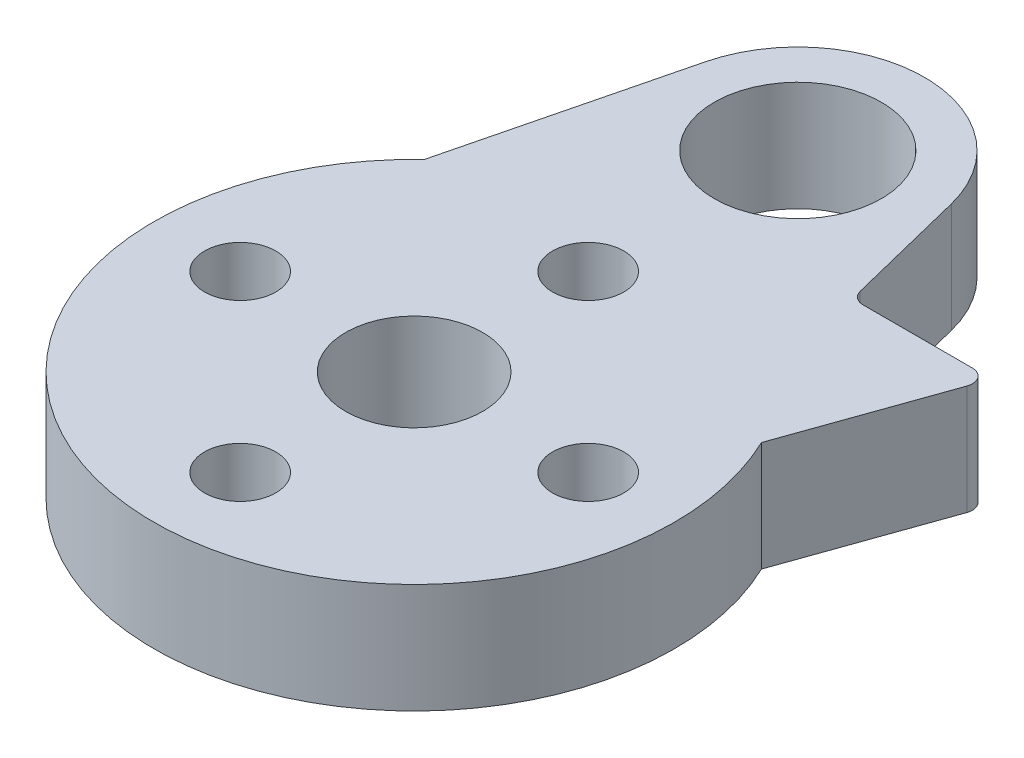
ISO-10303-21;
HEADER;
FILE_DESCRIPTION(('STEP AP214'),'2;1');
FILE_NAME('part.step','',(''),(''),'','','');
FILE_SCHEMA(('AUTOMOTIVE_DESIGN { 1 0 10303 214 1 1 1 1 }'));
ENDSEC;
DATA;
#1=APPLICATION_CONTEXT('core data for automotive mechanical design processes');
#2=APPLICATION_PROTOCOL_DEFINITION('international standard','automotive_design',2000,#1);
#3=PRODUCT_CONTEXT('',#1,'mechanical');
#4=PRODUCT('Part','Part','',(#3));
#5=PRODUCT_RELATED_PRODUCT_CATEGORY('part','',(#4));
#6=PRODUCT_DEFINITION_FORMATION('','',#4);
#7=PRODUCT_DEFINITION_CONTEXT('part definition',#1,'design');
#8=PRODUCT_DEFINITION('design','',#6,#7);
#9=PRODUCT_DEFINITION_SHAPE('','',#8);
#10=(LENGTH_UNIT() NAMED_UNIT(*) SI_UNIT(.MILLI.,.METRE.));
#11=(NAMED_UNIT(*) PLANE_ANGLE_UNIT() SI_UNIT($,.RADIAN.));
#12=(NAMED_UNIT(*) SI_UNIT($,.STERADIAN.) SOLID_ANGLE_UNIT());
#13=UNCERTAINTY_MEASURE_WITH_UNIT(LENGTH_MEASURE(1.E-05),#10,'distance_accuracy_value','');
#14=(GEOMETRIC_REPRESENTATION_CONTEXT(3) GLOBAL_UNCERTAINTY_ASSIGNED_CONTEXT((#13)) GLOBAL_UNIT_ASSIGNED_CONTEXT((#10,
#11,#12)) REPRESENTATION_CONTEXT('',''));
#15=CARTESIAN_POINT('',(0.,0.,0.));
#16=DIRECTION('',(0.,0.,1.));
#17=DIRECTION('',(1.,0.,0.));
#18=AXIS2_PLACEMENT_3D('',#15,#16,#17);
#19=CARTESIAN_POINT('',(0.,4.,-14.));
#20=DIRECTION('',(0.,1.,0.));
#21=DIRECTION('',(0.,0.,1.));
#22=AXIS2_PLACEMENT_3D('',#19,#20,#21);
#23=PLANE('',#22);
#24=CARTESIAN_POINT('',(0.,4.,0.));
#25=DIRECTION('',(0.,1.,0.));
#26=DIRECTION('',(0.,0.,1.));
#27=AXIS2_PLACEMENT_3D('',#24,#25,#26);
#28=CIRCLE('',#27,2.5);
#29=CARTESIAN_POINT('',(0.,4.,2.5));
#30=VERTEX_POINT('',#29);
#31=EDGE_CURVE('E210',#30,#30,#28,.T.);
#32=ORIENTED_EDGE('',*,*,#31,.F.);
#33=EDGE_LOOP('',(#32));
#34=FACE_BOUND('',#33,.T.);
#35=DIRECTION('',(0.334210095816249,0.,-0.942498600452273));
#36=VECTOR('',#35,1.);
#37=CARTESIAN_POINT('',(10.7671602285056,4.,-10.3094782942648));
#38=LINE('',#37,#36);
#39=CARTESIAN_POINT('',(8.56716583571937,4.,-4.10532209982151));
#40=VERTEX_POINT('',#39);
#41=CARTESIAN_POINT('',(10.5306047133315,4.,-9.64237324635669));
#42=VERTEX_POINT('',#41);
#43=EDGE_CURVE('E181',#40,#42,#38,.T.);
#44=ORIENTED_EDGE('',*,*,#43,.T.);
#45=CARTESIAN_POINT('',(10.0593554131053,4.,-9.80947829426481));
#46=DIRECTION('',(0.,1.,0.));
#47=DIRECTION('',(0.,0.,1.));
#48=AXIS2_PLACEMENT_3D('',#45,#46,#47);
#49=CIRCLE('',#48,0.5);
#50=CARTESIAN_POINT('',(10.0593554131053,4.,-10.3094782942648));
#51=VERTEX_POINT('',#50);
#52=EDGE_CURVE('E52',#42,#51,#49,.T.);
#53=ORIENTED_EDGE('',*,*,#52,.T.);
#54=DIRECTION('',(-1.,0.,0.));
#55=VECTOR('',#54,1.);
#56=CARTESIAN_POINT('',(10.7671602285056,4.,-10.3094782942648));
#57=LINE('',#56,#55);
#58=CARTESIAN_POINT('',(6.07332024028695,4.,-10.3094782942648));
#59=VERTEX_POINT('',#58);
#60=EDGE_CURVE('E162',#51,#59,#57,.T.);
#61=ORIENTED_EDGE('',*,*,#60,.T.);
#62=CARTESIAN_POINT('',(6.07332024028695,4.,-10.8094782942648));
#63=DIRECTION('',(0.,1.,0.));
#64=DIRECTION('',(0.,0.,1.));
#65=AXIS2_PLACEMENT_3D('',#62,#63,#64);
#66=CIRCLE('',#65,0.5);
#67=CARTESIAN_POINT('',(5.58806577176058,4.,-10.6889457228362));
#68=VERTEX_POINT('',#67);
#69=EDGE_CURVE('E45',#59,#68,#66,.F.);
#70=ORIENTED_EDGE('',*,*,#69,.T.);
#71=DIRECTION('',(-0.241065142857143,0.,-0.970508937052753));
#72=VECTOR('',#71,1.);
#73=CARTESIAN_POINT('',(4.48868923865544,4.,-15.1149474994469));
#74=LINE('',#73,#72);
#75=CARTESIAN_POINT('',(4.48868923865544,4.,-15.1149474994469));
#76=VERTEX_POINT('',#75);
#77=EDGE_CURVE('E130',#68,#76,#74,.T.);
#78=ORIENTED_EDGE('',*,*,#77,.T.);
#79=CARTESIAN_POINT('',(0.,4.,-14.));
#80=DIRECTION('',(0.,1.,0.));
#81=DIRECTION('',(0.,0.,1.));
#82=AXIS2_PLACEMENT_3D('',#79,#80,#81);
#83=CIRCLE('',#82,4.625088);
#84=CARTESIAN_POINT('',(-4.48868923865544,4.,-15.1149474994469));
#85=VERTEX_POINT('',#84);
#86=EDGE_CURVE('E128',#76,#85,#83,.T.);
#87=ORIENTED_EDGE('',*,*,#86,.T.);
#88=DIRECTION('',(-0.241065142857143,0.,0.970508937052753));
#89=VECTOR('',#88,1.);
#90=CARTESIAN_POINT('',(-4.48868923865544,4.,-15.1149474994469));
#91=LINE('',#90,#89);
#92=CARTESIAN_POINT('',(-6.52898017129895,4.,-6.90089979080882));
#93=VERTEX_POINT('',#92);
#94=EDGE_CURVE('E121',#85,#93,#91,.T.);
#95=ORIENTED_EDGE('',*,*,#94,.T.);
#96=CARTESIAN_POINT('',(0.,4.,0.));
#97=DIRECTION('',(0.,1.,0.));
#98=DIRECTION('',(0.,0.,1.));
#99=AXIS2_PLACEMENT_3D('',#96,#97,#98);
#100=CIRCLE('',#99,9.5);
#101=EDGE_CURVE('E102',#93,#40,#100,.T.);
#102=ORIENTED_EDGE('',*,*,#101,.T.);
#103=EDGE_LOOP('',(#44,#53,#61,#70,#78,#87,#95,#102));
#104=FACE_BOUND('',#103,.T.);
#105=CARTESIAN_POINT('',(0.,4.,-14.));
#106=DIRECTION('',(0.,1.,0.));
#107=DIRECTION('',(0.,0.,1.));
#108=AXIS2_PLACEMENT_3D('',#105,#106,#107);
#109=CIRCLE('',#108,3.05);
#110=CARTESIAN_POINT('',(0.,4.,-10.95));
#111=VERTEX_POINT('',#110);
#112=EDGE_CURVE('E141',#111,#111,#109,.T.);
#113=ORIENTED_EDGE('',*,*,#112,.F.);
#114=EDGE_LOOP('',(#113));
#115=FACE_BOUND('',#114,.T.);
#116=CARTESIAN_POINT('',(6.35000000000018,4.,-1.79311378806878E-13));
#117=DIRECTION('',(0.,1.,0.));
#118=DIRECTION('',(0.,0.,1.));
#119=AXIS2_PLACEMENT_3D('',#116,#117,#118);
#120=CIRCLE('',#119,1.30000000000014);
#121=CARTESIAN_POINT('',(6.35000000000018,4.,1.29999999999996));
#122=VERTEX_POINT('',#121);
#123=EDGE_CURVE('E196',#122,#122,#120,.T.);
#124=ORIENTED_EDGE('',*,*,#123,.F.);
#125=EDGE_LOOP('',(#124));
#126=FACE_BOUND('',#125,.T.);
#127=CARTESIAN_POINT('',(0.,4.,-6.35));
#128=DIRECTION('',(0.,1.,0.));
#129=DIRECTION('',(0.,0.,1.));
#130=AXIS2_PLACEMENT_3D('',#127,#128,#129);
#131=CIRCLE('',#130,1.3);
#132=CARTESIAN_POINT('',(0.,4.,-5.05));
#133=VERTEX_POINT('',#132);
#134=EDGE_CURVE('E190',#133,#133,#131,.T.);
#135=ORIENTED_EDGE('',*,*,#134,.F.);
#136=EDGE_LOOP('',(#135));
#137=FACE_BOUND('',#136,.T.);
#138=CARTESIAN_POINT('',(-6.34999999999982,4.,1.80089029524336E-13));
#139=DIRECTION('',(0.,1.,0.));
#140=DIRECTION('',(0.,0.,1.));
#141=AXIS2_PLACEMENT_3D('',#138,#139,#140);
#142=CIRCLE('',#141,1.30000000000029);
#143=CARTESIAN_POINT('',(-6.34999999999982,4.,1.30000000000047));
#144=VERTEX_POINT('',#143);
#145=EDGE_CURVE('E124',#144,#144,#142,.T.);
#146=ORIENTED_EDGE('',*,*,#145,.F.);
#147=EDGE_LOOP('',(#146));
#148=FACE_BOUND('',#147,.T.);
#149=CARTESIAN_POINT('',(3.58622757613755E-13,4.,6.35));
#150=DIRECTION('',(0.,1.,0.));
#151=DIRECTION('',(0.,0.,1.));
#152=AXIS2_PLACEMENT_3D('',#149,#150,#151);
#153=CIRCLE('',#152,1.30000000000039);
#154=CARTESIAN_POINT('',(3.58622757613755E-13,4.,7.65000000000039));
#155=VERTEX_POINT('',#154);
#156=EDGE_CURVE('E202',#155,#155,#153,.T.);
#157=ORIENTED_EDGE('',*,*,#156,.F.);
#158=EDGE_LOOP('',(#157));
#159=FACE_BOUND('',#158,.T.);
#160=ADVANCED_FACE('F37',(#34,#104,#115,#126,#137,#148,#159),#23,.T.);
#161=CARTESIAN_POINT('',(0.,0.,-14.));
#162=DIRECTION('',(0.,1.,0.));
#163=DIRECTION('',(0.,0.,1.));
#164=AXIS2_PLACEMENT_3D('',#161,#162,#163);
#165=PLANE('',#164);
#166=CARTESIAN_POINT('',(0.,0.,0.));
#167=DIRECTION('',(0.,1.,0.));
#168=DIRECTION('',(0.,0.,1.));
#169=AXIS2_PLACEMENT_3D('',#166,#167,#168);
#170=CIRCLE('',#169,2.5);
#171=CARTESIAN_POINT('',(0.,0.,2.5));
#172=VERTEX_POINT('',#171);
#173=EDGE_CURVE('E189',#172,#172,#170,.T.);
#174=ORIENTED_EDGE('',*,*,#173,.T.);
#175=EDGE_LOOP('',(#174));
#176=FACE_BOUND('',#175,.T.);
#177=CARTESIAN_POINT('',(0.,0.,-14.));
#178=DIRECTION('',(0.,1.,0.));
#179=DIRECTION('',(0.,0.,1.));
#180=AXIS2_PLACEMENT_3D('',#177,#178,#179);
#181=CIRCLE('',#180,3.05);
#182=CARTESIAN_POINT('',(0.,0.,-10.95));
#183=VERTEX_POINT('',#182);
#184=EDGE_CURVE('E213',#183,#183,#181,.T.);
#185=ORIENTED_EDGE('',*,*,#184,.T.);
#186=EDGE_LOOP('',(#185));
#187=FACE_BOUND('',#186,.T.);
#188=CARTESIAN_POINT('',(6.35000000000018,0.,-1.79311378806878E-13));
#189=DIRECTION('',(0.,1.,0.));
#190=DIRECTION('',(0.,0.,1.));
#191=AXIS2_PLACEMENT_3D('',#188,#189,#190);
#192=CIRCLE('',#191,1.30000000000014);
#193=CARTESIAN_POINT('',(6.35000000000018,0.,1.29999999999996));
#194=VERTEX_POINT('',#193);
#195=EDGE_CURVE('E193',#194,#194,#192,.T.);
#196=ORIENTED_EDGE('',*,*,#195,.T.);
#197=EDGE_LOOP('',(#196));
#198=FACE_BOUND('',#197,.T.);
#199=CARTESIAN_POINT('',(0.,0.,-6.35));
#200=DIRECTION('',(0.,1.,0.));
#201=DIRECTION('',(0.,0.,1.));
#202=AXIS2_PLACEMENT_3D('',#199,#200,#201);
#203=CIRCLE('',#202,1.3);
#204=CARTESIAN_POINT('',(0.,0.,-5.05));
#205=VERTEX_POINT('',#204);
#206=EDGE_CURVE('E186',#205,#205,#203,.T.);
#207=ORIENTED_EDGE('',*,*,#206,.T.);
#208=EDGE_LOOP('',(#207));
#209=FACE_BOUND('',#208,.T.);
#210=CARTESIAN_POINT('',(-6.34999999999982,0.,1.80089029524336E-13));
#211=DIRECTION('',(0.,1.,0.));
#212=DIRECTION('',(0.,0.,1.));
#213=AXIS2_PLACEMENT_3D('',#210,#211,#212);
#214=CIRCLE('',#213,1.30000000000029);
#215=CARTESIAN_POINT('',(-6.34999999999982,0.,1.30000000000047));
#216=VERTEX_POINT('',#215);
#217=EDGE_CURVE('E205',#216,#216,#214,.T.);
#218=ORIENTED_EDGE('',*,*,#217,.T.);
#219=EDGE_LOOP('',(#218));
#220=FACE_BOUND('',#219,.T.);
#221=DIRECTION('',(1.,0.,0.));
#222=VECTOR('',#221,1.);
#223=CARTESIAN_POINT('',(10.7671602285056,0.,-10.3094782942648));
#224=LINE('',#223,#222);
#225=CARTESIAN_POINT('',(6.07332024028695,0.,-10.3094782942648));
#226=VERTEX_POINT('',#225);
#227=CARTESIAN_POINT('',(10.0593554131053,0.,-10.3094782942648));
#228=VERTEX_POINT('',#227);
#229=EDGE_CURVE('E115',#226,#228,#224,.T.);
#230=ORIENTED_EDGE('',*,*,#229,.T.);
#231=CARTESIAN_POINT('',(10.0593554131053,0.,-9.80947829426481));
#232=DIRECTION('',(0.,1.,0.));
#233=DIRECTION('',(0.,0.,1.));
#234=AXIS2_PLACEMENT_3D('',#231,#232,#233);
#235=CIRCLE('',#234,0.5);
#236=CARTESIAN_POINT('',(10.5306047133315,0.,-9.64237324635669));
#237=VERTEX_POINT('',#236);
#238=EDGE_CURVE('E60',#228,#237,#235,.F.);
#239=ORIENTED_EDGE('',*,*,#238,.T.);
#240=DIRECTION('',(-0.334210095816249,0.,0.942498600452273));
#241=VECTOR('',#240,1.);
#242=CARTESIAN_POINT('',(10.7671602285056,0.,-10.3094782942648));
#243=LINE('',#242,#241);
#244=CARTESIAN_POINT('',(8.56716583571937,0.,-4.10532209982151));
#245=VERTEX_POINT('',#244);
#246=EDGE_CURVE('E177',#237,#245,#243,.T.);
#247=ORIENTED_EDGE('',*,*,#246,.T.);
#248=CARTESIAN_POINT('',(0.,0.,0.));
#249=DIRECTION('',(0.,1.,0.));
#250=DIRECTION('',(0.,0.,1.));
#251=AXIS2_PLACEMENT_3D('',#248,#249,#250);
#252=CIRCLE('',#251,9.5);
#253=CARTESIAN_POINT('',(-6.52898017129895,0.,-6.90089979080882));
#254=VERTEX_POINT('',#253);
#255=EDGE_CURVE('E114',#254,#245,#252,.T.);
#256=ORIENTED_EDGE('',*,*,#255,.F.);
#257=DIRECTION('',(-0.241065142857143,0.,0.970508937052753));
#258=VECTOR('',#257,1.);
#259=CARTESIAN_POINT('',(-4.48868923865544,0.,-15.1149474994469));
#260=LINE('',#259,#258);
#261=CARTESIAN_POINT('',(-4.48868923865544,0.,-15.1149474994469));
#262=VERTEX_POINT('',#261);
#263=EDGE_CURVE('E123',#262,#254,#260,.T.);
#264=ORIENTED_EDGE('',*,*,#263,.F.);
#265=CARTESIAN_POINT('',(0.,0.,-14.));
#266=DIRECTION('',(0.,1.,0.));
#267=DIRECTION('',(0.,0.,1.));
#268=AXIS2_PLACEMENT_3D('',#265,#266,#267);
#269=CIRCLE('',#268,4.625088);
#270=CARTESIAN_POINT('',(4.48868923865544,0.,-15.1149474994469));
#271=VERTEX_POINT('',#270);
#272=EDGE_CURVE('E138',#271,#262,#269,.T.);
#273=ORIENTED_EDGE('',*,*,#272,.F.);
#274=DIRECTION('',(-0.241065142857143,0.,-0.970508937052753));
#275=VECTOR('',#274,1.);
#276=CARTESIAN_POINT('',(4.48868923865544,0.,-15.1149474994469));
#277=LINE('',#276,#275);
#278=CARTESIAN_POINT('',(5.58806577176058,0.,-10.6889457228362));
#279=VERTEX_POINT('',#278);
#280=EDGE_CURVE('E134',#279,#271,#277,.T.);
#281=ORIENTED_EDGE('',*,*,#280,.F.);
#282=CARTESIAN_POINT('',(6.07332024028695,0.,-10.8094782942648));
#283=DIRECTION('',(0.,1.,0.));
#284=DIRECTION('',(0.,0.,1.));
#285=AXIS2_PLACEMENT_3D('',#282,#283,#284);
#286=CIRCLE('',#285,0.5);
#287=EDGE_CURVE('E11',#279,#226,#286,.T.);
#288=ORIENTED_EDGE('',*,*,#287,.T.);
#289=EDGE_LOOP('',(#230,#239,#247,#256,#264,#273,#281,#288));
#290=FACE_BOUND('',#289,.T.);
#291=CARTESIAN_POINT('',(3.58622757613755E-13,0.,6.35));
#292=DIRECTION('',(0.,1.,0.));
#293=DIRECTION('',(0.,0.,1.));
#294=AXIS2_PLACEMENT_3D('',#291,#292,#293);
#295=CIRCLE('',#294,1.30000000000039);
#296=CARTESIAN_POINT('',(3.58622757613755E-13,0.,7.65000000000039));
#297=VERTEX_POINT('',#296);
#298=EDGE_CURVE('E199',#297,#297,#295,.T.);
#299=ORIENTED_EDGE('',*,*,#298,.T.);
#300=EDGE_LOOP('',(#299));
#301=FACE_BOUND('',#300,.T.);
#302=ADVANCED_FACE('F172',(#176,#187,#198,#209,#220,#290,#301),#165,.F.);
#303=CARTESIAN_POINT('',(0.,4.,-14.));
#304=DIRECTION('',(0.,-1.,0.));
#305=DIRECTION('',(0.,0.,-1.));
#306=AXIS2_PLACEMENT_3D('',#303,#304,#305);
#307=CYLINDRICAL_SURFACE('',#306,4.625088);
#308=ORIENTED_EDGE('',*,*,#272,.T.);
#309=DIRECTION('',(0.,-1.,0.));
#310=VECTOR('',#309,1.);
#311=CARTESIAN_POINT('',(-4.48868923865544,4.,-15.1149474994469));
#312=LINE('',#311,#310);
#313=EDGE_CURVE('E146',#85,#262,#312,.T.);
#314=ORIENTED_EDGE('',*,*,#313,.F.);
#315=ORIENTED_EDGE('',*,*,#86,.F.);
#316=DIRECTION('',(0.,-1.,0.));
#317=VECTOR('',#316,1.);
#318=CARTESIAN_POINT('',(4.48868923865544,4.,-15.1149474994469));
#319=LINE('',#318,#317);
#320=EDGE_CURVE('E132',#76,#271,#319,.T.);
#321=ORIENTED_EDGE('',*,*,#320,.T.);
#322=EDGE_LOOP('',(#308,#314,#315,#321));
#323=FACE_BOUND('',#322,.T.);
#324=ADVANCED_FACE('F241',(#323),#307,.T.);
#325=CARTESIAN_POINT('',(-4.48868923865544,4.,-15.1149474994469));
#326=DIRECTION('',(0.970508937052753,0.,0.241065142857143));
#327=DIRECTION('',(0.241065142857143,0.,-0.970508937052754));
#328=AXIS2_PLACEMENT_3D('',#325,#326,#327);
#329=PLANE('',#328);
#330=ORIENTED_EDGE('',*,*,#263,.T.);
#331=DIRECTION('',(0.,1.,0.));
#332=VECTOR('',#331,1.);
#333=CARTESIAN_POINT('',(-6.52898017129894,0.,-6.90089979080882));
#334=LINE('',#333,#332);
#335=EDGE_CURVE('E106',#254,#93,#334,.T.);
#336=ORIENTED_EDGE('',*,*,#335,.T.);
#337=ORIENTED_EDGE('',*,*,#94,.F.);
#338=ORIENTED_EDGE('',*,*,#313,.T.);
#339=EDGE_LOOP('',(#330,#336,#337,#338));
#340=FACE_BOUND('',#339,.T.);
#341=ADVANCED_FACE('F119',(#340),#329,.F.);
#342=CARTESIAN_POINT('',(4.48868923865544,4.,-15.1149474994469));
#343=DIRECTION('',(-0.970508937052753,0.,0.241065142857143));
#344=DIRECTION('',(0.241065142857143,0.,0.970508937052753));
#345=AXIS2_PLACEMENT_3D('',#342,#343,#344);
#346=PLANE('',#345);
#347=ORIENTED_EDGE('',*,*,#77,.F.);
#348=DIRECTION('',(0.,1.,0.));
#349=VECTOR('',#348,1.);
#350=CARTESIAN_POINT('',(5.58806577176058,4.,-10.6889457228362));
#351=LINE('',#350,#349);
#352=EDGE_CURVE('E153',#68,#279,#351,.F.);
#353=ORIENTED_EDGE('',*,*,#352,.T.);
#354=ORIENTED_EDGE('',*,*,#280,.T.);
#355=ORIENTED_EDGE('',*,*,#320,.F.);
#356=EDGE_LOOP('',(#347,#353,#354,#355));
#357=FACE_BOUND('',#356,.T.);
#358=ADVANCED_FACE('F167',(#357),#346,.F.);
#359=CARTESIAN_POINT('',(0.,4.,-14.));
#360=DIRECTION('',(0.,-1.,0.));
#361=DIRECTION('',(0.,0.,-1.));
#362=AXIS2_PLACEMENT_3D('',#359,#360,#361);
#363=CYLINDRICAL_SURFACE('',#362,3.05);
#364=ORIENTED_EDGE('',*,*,#112,.T.);
#365=EDGE_LOOP('',(#364));
#366=FACE_BOUND('',#365,.T.);
#367=ORIENTED_EDGE('',*,*,#184,.F.);
#368=EDGE_LOOP('',(#367));
#369=FACE_BOUND('',#368,.T.);
#370=ADVANCED_FACE('F222',(#366,#369),#363,.F.);
#371=CARTESIAN_POINT('',(0.,4.,0.));
#372=DIRECTION('',(0.,-1.,0.));
#373=DIRECTION('',(0.,0.,-1.));
#374=AXIS2_PLACEMENT_3D('',#371,#372,#373);
#375=CYLINDRICAL_SURFACE('',#374,2.5);
#376=ORIENTED_EDGE('',*,*,#173,.F.);
#377=EDGE_LOOP('',(#376));
#378=FACE_BOUND('',#377,.T.);
#379=ORIENTED_EDGE('',*,*,#31,.T.);
#380=EDGE_LOOP('',(#379));
#381=FACE_BOUND('',#380,.T.);
#382=ADVANCED_FACE('F224',(#378,#381),#375,.F.);
#383=CARTESIAN_POINT('',(-6.34999999999982,0.,1.80089029524336E-13));
#384=DIRECTION('',(0.,1.,0.));
#385=DIRECTION('',(0.,0.,1.));
#386=AXIS2_PLACEMENT_3D('',#383,#384,#385);
#387=CYLINDRICAL_SURFACE('',#386,1.30000000000029);
#388=ORIENTED_EDGE('',*,*,#145,.T.);
#389=EDGE_LOOP('',(#388));
#390=FACE_BOUND('',#389,.T.);
#391=ORIENTED_EDGE('',*,*,#217,.F.);
#392=EDGE_LOOP('',(#391));
#393=FACE_BOUND('',#392,.T.);
#394=ADVANCED_FACE('F231',(#390,#393),#387,.F.);
#395=CARTESIAN_POINT('',(3.58622757613755E-13,0.,6.35));
#396=DIRECTION('',(0.,1.,0.));
#397=DIRECTION('',(0.,0.,1.));
#398=AXIS2_PLACEMENT_3D('',#395,#396,#397);
#399=CYLINDRICAL_SURFACE('',#398,1.30000000000039);
#400=ORIENTED_EDGE('',*,*,#156,.T.);
#401=EDGE_LOOP('',(#400));
#402=FACE_BOUND('',#401,.T.);
#403=ORIENTED_EDGE('',*,*,#298,.F.);
#404=EDGE_LOOP('',(#403));
#405=FACE_BOUND('',#404,.T.);
#406=ADVANCED_FACE('F272',(#402,#405),#399,.F.);
#407=CARTESIAN_POINT('',(6.35000000000018,0.,-1.79311378806878E-13));
#408=DIRECTION('',(0.,1.,0.));
#409=DIRECTION('',(0.,0.,1.));
#410=AXIS2_PLACEMENT_3D('',#407,#408,#409);
#411=CYLINDRICAL_SURFACE('',#410,1.30000000000014);
#412=ORIENTED_EDGE('',*,*,#123,.T.);
#413=EDGE_LOOP('',(#412));
#414=FACE_BOUND('',#413,.T.);
#415=ORIENTED_EDGE('',*,*,#195,.F.);
#416=EDGE_LOOP('',(#415));
#417=FACE_BOUND('',#416,.T.);
#418=ADVANCED_FACE('F268',(#414,#417),#411,.F.);
#419=CARTESIAN_POINT('',(0.,0.,-6.35));
#420=DIRECTION('',(0.,1.,0.));
#421=DIRECTION('',(0.,0.,1.));
#422=AXIS2_PLACEMENT_3D('',#419,#420,#421);
#423=CYLINDRICAL_SURFACE('',#422,1.3);
#424=ORIENTED_EDGE('',*,*,#134,.T.);
#425=EDGE_LOOP('',(#424));
#426=FACE_BOUND('',#425,.T.);
#427=ORIENTED_EDGE('',*,*,#206,.F.);
#428=EDGE_LOOP('',(#427));
#429=FACE_BOUND('',#428,.T.);
#430=ADVANCED_FACE('F265',(#426,#429),#423,.F.);
#431=CARTESIAN_POINT('',(0.,0.,0.));
#432=DIRECTION('',(0.,1.,0.));
#433=DIRECTION('',(0.,0.,1.));
#434=AXIS2_PLACEMENT_3D('',#431,#432,#433);
#435=CYLINDRICAL_SURFACE('',#434,9.5);
#436=DIRECTION('',(0.,1.,0.));
#437=VECTOR('',#436,1.);
#438=CARTESIAN_POINT('',(8.56716583571937,-12.7518004054565,-4.10532209982151));
#439=LINE('',#438,#437);
#440=EDGE_CURVE('E109',#245,#40,#439,.T.);
#441=ORIENTED_EDGE('',*,*,#440,.T.);
#442=ORIENTED_EDGE('',*,*,#101,.F.);
#443=ORIENTED_EDGE('',*,*,#335,.F.);
#444=ORIENTED_EDGE('',*,*,#255,.T.);
#445=EDGE_LOOP('',(#441,#442,#443,#444));
#446=FACE_BOUND('',#445,.T.);
#447=ADVANCED_FACE('F104',(#446),#435,.T.);
#448=CARTESIAN_POINT('',(10.7671602285056,-12.7518004054565,-10.3094782942648));
#449=DIRECTION('',(0.,0.,-1.));
#450=DIRECTION('',(-1.,0.,0.));
#451=AXIS2_PLACEMENT_3D('',#448,#449,#450);
#452=PLANE('',#451);
#453=ORIENTED_EDGE('',*,*,#229,.F.);
#454=DIRECTION('',(0.,1.,0.));
#455=VECTOR('',#454,1.);
#456=CARTESIAN_POINT('',(6.07332024028695,-12.7518004054565,-10.3094782942648));
#457=LINE('',#456,#455);
#458=EDGE_CURVE('E150',#226,#59,#457,.T.);
#459=ORIENTED_EDGE('',*,*,#458,.T.);
#460=ORIENTED_EDGE('',*,*,#60,.F.);
#461=DIRECTION('',(0.,1.,0.));
#462=VECTOR('',#461,1.);
#463=CARTESIAN_POINT('',(10.0593554131053,-12.7518004054565,-10.3094782942648));
#464=LINE('',#463,#462);
#465=EDGE_CURVE('E148',#51,#228,#464,.F.);
#466=ORIENTED_EDGE('',*,*,#465,.T.);
#467=EDGE_LOOP('',(#453,#459,#460,#466));
#468=FACE_BOUND('',#467,.T.);
#469=ADVANCED_FACE('F176',(#468),#452,.T.);
#470=CARTESIAN_POINT('',(10.7671602285056,-12.7518004054565,-10.3094782942648));
#471=DIRECTION('',(0.942498600452273,0.,0.334210095816249));
#472=DIRECTION('',(0.334210095816249,0.,-0.942498600452273));
#473=AXIS2_PLACEMENT_3D('',#470,#471,#472);
#474=PLANE('',#473);
#475=ORIENTED_EDGE('',*,*,#246,.F.);
#476=DIRECTION('',(0.,1.,0.));
#477=VECTOR('',#476,1.);
#478=CARTESIAN_POINT('',(10.5306047133315,-12.7518004054565,-9.64237324635669));
#479=LINE('',#478,#477);
#480=EDGE_CURVE('E155',#237,#42,#479,.T.);
#481=ORIENTED_EDGE('',*,*,#480,.T.);
#482=ORIENTED_EDGE('',*,*,#43,.F.);
#483=ORIENTED_EDGE('',*,*,#440,.F.);
#484=EDGE_LOOP('',(#475,#481,#482,#483));
#485=FACE_BOUND('',#484,.T.);
#486=ADVANCED_FACE('F251',(#485),#474,.T.);
#487=CARTESIAN_POINT('',(6.07332024028695,-12.7518004054565,-10.8094782942648));
#488=DIRECTION('',(0.,1.,0.));
#489=DIRECTION('',(0.,0.,1.));
#490=AXIS2_PLACEMENT_3D('',#487,#488,#489);
#491=CYLINDRICAL_SURFACE('',#490,0.5);
#492=ORIENTED_EDGE('',*,*,#287,.F.);
#493=ORIENTED_EDGE('',*,*,#352,.F.);
#494=ORIENTED_EDGE('',*,*,#69,.F.);
#495=ORIENTED_EDGE('',*,*,#458,.F.);
#496=EDGE_LOOP('',(#492,#493,#494,#495));
#497=FACE_BOUND('',#496,.T.);
#498=ADVANCED_FACE('F170',(#497),#491,.F.);
#499=CARTESIAN_POINT('',(10.0593554131053,-12.7518004054565,-9.80947829426481));
#500=DIRECTION('',(0.,1.,0.));
#501=DIRECTION('',(0.,0.,1.));
#502=AXIS2_PLACEMENT_3D('',#499,#500,#501);
#503=CYLINDRICAL_SURFACE('',#502,0.5);
#504=ORIENTED_EDGE('',*,*,#238,.F.);
#505=ORIENTED_EDGE('',*,*,#465,.F.);
#506=ORIENTED_EDGE('',*,*,#52,.F.);
#507=ORIENTED_EDGE('',*,*,#480,.F.);
#508=EDGE_LOOP('',(#504,#505,#506,#507));
#509=FACE_BOUND('',#508,.T.);
#510=ADVANCED_FACE('F39',(#509),#503,.T.);
#511=CLOSED_SHELL('',(#160,#302,#324,#341,#358,#370,#382,#394,#406,#418,#430,#447,#469,#486,
#498,#510));
#512=MANIFOLD_SOLID_BREP('B2',#511);
#513=ADVANCED_BREP_SHAPE_REPRESENTATION('',(#18,#512),#14);
#514=SHAPE_DEFINITION_REPRESENTATION(#9,#513);
ENDSEC;
END-ISO-10303-21;
